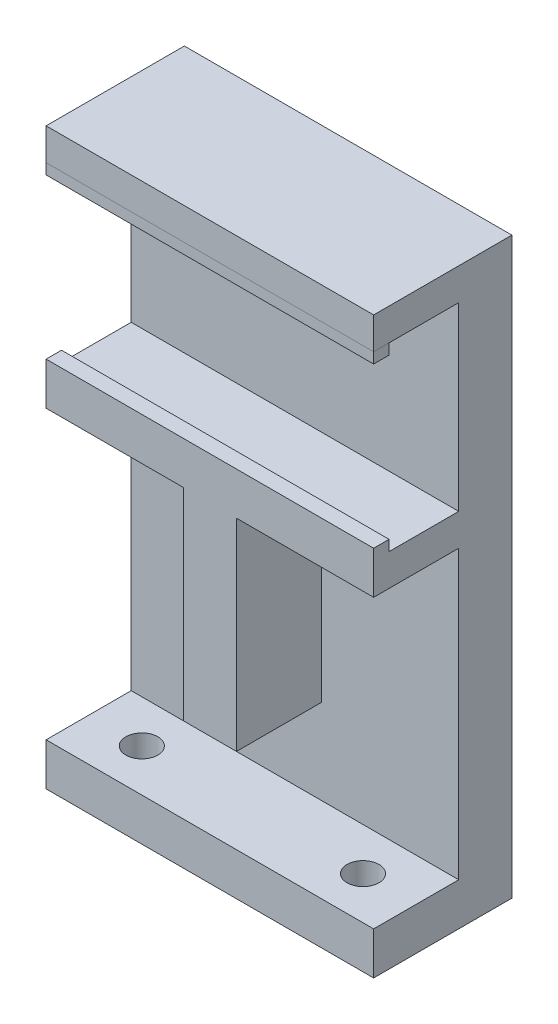
ISO-10303-21;
HEADER;
FILE_DESCRIPTION(('STEP AP214'),'2;1');
FILE_NAME('part.step','',(''),(''),'','','');
FILE_SCHEMA(('AUTOMOTIVE_DESIGN { 1 0 10303 214 1 1 1 1 }'));
ENDSEC;
DATA;
#1=APPLICATION_CONTEXT('core data for automotive mechanical design processes');
#2=APPLICATION_PROTOCOL_DEFINITION('international standard','automotive_design',2000,#1);
#3=PRODUCT_CONTEXT('',#1,'mechanical');
#4=PRODUCT('Part','Part','',(#3));
#5=PRODUCT_RELATED_PRODUCT_CATEGORY('part','',(#4));
#6=PRODUCT_DEFINITION_FORMATION('','',#4);
#7=PRODUCT_DEFINITION_CONTEXT('part definition',#1,'design');
#8=PRODUCT_DEFINITION('design','',#6,#7);
#9=PRODUCT_DEFINITION_SHAPE('','',#8);
#10=(LENGTH_UNIT() NAMED_UNIT(*) SI_UNIT(.MILLI.,.METRE.));
#11=(NAMED_UNIT(*) PLANE_ANGLE_UNIT() SI_UNIT($,.RADIAN.));
#12=(NAMED_UNIT(*) SI_UNIT($,.STERADIAN.) SOLID_ANGLE_UNIT());
#13=UNCERTAINTY_MEASURE_WITH_UNIT(LENGTH_MEASURE(1.E-05),#10,'distance_accuracy_value','');
#14=(GEOMETRIC_REPRESENTATION_CONTEXT(3) GLOBAL_UNCERTAINTY_ASSIGNED_CONTEXT((#13)) GLOBAL_UNIT_ASSIGNED_CONTEXT((#10,
#11,#12)) REPRESENTATION_CONTEXT('',''));
#15=CARTESIAN_POINT('',(0.,0.,0.));
#16=DIRECTION('',(0.,0.,1.));
#17=DIRECTION('',(1.,0.,0.));
#18=AXIS2_PLACEMENT_3D('',#15,#16,#17);
#19=CARTESIAN_POINT('',(-5.00000000014378E-05,39.,13.));
#20=DIRECTION('',(0.,0.,1.));
#21=DIRECTION('',(1.,0.,0.));
#22=AXIS2_PLACEMENT_3D('',#19,#20,#21);
#23=PLANE('',#22);
#24=DIRECTION('',(0.,-1.,0.));
#25=VECTOR('',#24,1.);
#26=CARTESIAN_POINT('',(30.8,39.,13.));
#27=LINE('',#26,#25);
#28=CARTESIAN_POINT('',(30.8,39.,13.));
#29=VERTEX_POINT('',#28);
#30=CARTESIAN_POINT('',(30.8,38.,13.));
#31=VERTEX_POINT('',#30);
#32=EDGE_CURVE('E111',#29,#31,#27,.T.);
#33=ORIENTED_EDGE('',*,*,#32,.F.);
#34=DIRECTION('',(1.,0.,0.));
#35=VECTOR('',#34,1.);
#36=CARTESIAN_POINT('',(-5.00000000014378E-05,39.,13.));
#37=LINE('',#36,#35);
#38=CARTESIAN_POINT('',(-5.00000000014378E-05,39.,13.));
#39=VERTEX_POINT('',#38);
#40=EDGE_CURVE('E12',#39,#29,#37,.T.);
#41=ORIENTED_EDGE('',*,*,#40,.F.);
#42=DIRECTION('',(0.,-1.,0.));
#43=VECTOR('',#42,1.);
#44=CARTESIAN_POINT('',(-5.00000000014378E-05,39.,13.));
#45=LINE('',#44,#43);
#46=CARTESIAN_POINT('',(-5.00000000014378E-05,38.,13.));
#47=VERTEX_POINT('',#46);
#48=EDGE_CURVE('E105',#39,#47,#45,.T.);
#49=ORIENTED_EDGE('',*,*,#48,.T.);
#50=DIRECTION('',(1.,0.,0.));
#51=VECTOR('',#50,1.);
#52=CARTESIAN_POINT('',(-5.00000000014378E-05,38.,13.));
#53=LINE('',#52,#51);
#54=EDGE_CURVE('E50',#47,#31,#53,.T.);
#55=ORIENTED_EDGE('',*,*,#54,.T.);
#56=EDGE_LOOP('',(#33,#41,#49,#55));
#57=FACE_BOUND('',#56,.T.);
#58=ADVANCED_FACE('F47',(#57),#23,.T.);
#59=CARTESIAN_POINT('',(-5.00000000014378E-05,39.,13.));
#60=DIRECTION('',(0.,1.,0.));
#61=DIRECTION('',(0.,0.,1.));
#62=AXIS2_PLACEMENT_3D('',#59,#60,#61);
#63=PLANE('',#62);
#64=DIRECTION('',(0.,0.,1.));
#65=VECTOR('',#64,1.);
#66=CARTESIAN_POINT('',(30.8,39.,13.));
#67=LINE('',#66,#65);
#68=CARTESIAN_POINT('',(30.8,39.,11.55));
#69=VERTEX_POINT('',#68);
#70=EDGE_CURVE('E107',#69,#29,#67,.T.);
#71=ORIENTED_EDGE('',*,*,#70,.F.);
#72=DIRECTION('',(1.,0.,0.));
#73=VECTOR('',#72,1.);
#74=CARTESIAN_POINT('',(-5.00000000014378E-05,39.,11.55));
#75=LINE('',#74,#73);
#76=CARTESIAN_POINT('',(-5.00000000014378E-05,39.,11.55));
#77=VERTEX_POINT('',#76);
#78=EDGE_CURVE('E56',#77,#69,#75,.T.);
#79=ORIENTED_EDGE('',*,*,#78,.F.);
#80=DIRECTION('',(0.,0.,1.));
#81=VECTOR('',#80,1.);
#82=CARTESIAN_POINT('',(-5.00000000014378E-05,39.,13.));
#83=LINE('',#82,#81);
#84=EDGE_CURVE('E102',#77,#39,#83,.T.);
#85=ORIENTED_EDGE('',*,*,#84,.T.);
#86=ORIENTED_EDGE('',*,*,#40,.T.);
#87=EDGE_LOOP('',(#71,#79,#85,#86));
#88=FACE_BOUND('',#87,.T.);
#89=ADVANCED_FACE('F121',(#88),#63,.T.);
#90=CARTESIAN_POINT('',(-5.00000000014378E-05,39.,11.55));
#91=DIRECTION('',(0.,0.,-1.));
#92=DIRECTION('',(-1.,0.,0.));
#93=AXIS2_PLACEMENT_3D('',#90,#91,#92);
#94=PLANE('',#93);
#95=DIRECTION('',(0.,1.,0.));
#96=VECTOR('',#95,1.);
#97=CARTESIAN_POINT('',(30.8,39.,11.55));
#98=LINE('',#97,#96);
#99=CARTESIAN_POINT('',(30.8,38.,11.55));
#100=VERTEX_POINT('',#99);
#101=EDGE_CURVE('E97',#100,#69,#98,.T.);
#102=ORIENTED_EDGE('',*,*,#101,.F.);
#103=DIRECTION('',(1.,0.,0.));
#104=VECTOR('',#103,1.);
#105=CARTESIAN_POINT('',(-5.00000000014378E-05,38.,11.55));
#106=LINE('',#105,#104);
#107=CARTESIAN_POINT('',(-5.00000000014378E-05,38.,11.55));
#108=VERTEX_POINT('',#107);
#109=EDGE_CURVE('E92',#108,#100,#106,.T.);
#110=ORIENTED_EDGE('',*,*,#109,.F.);
#111=DIRECTION('',(0.,1.,0.));
#112=VECTOR('',#111,1.);
#113=CARTESIAN_POINT('',(-5.00000000014378E-05,39.,11.55));
#114=LINE('',#113,#112);
#115=EDGE_CURVE('E95',#108,#77,#114,.T.);
#116=ORIENTED_EDGE('',*,*,#115,.T.);
#117=ORIENTED_EDGE('',*,*,#78,.T.);
#118=EDGE_LOOP('',(#102,#110,#116,#117));
#119=FACE_BOUND('',#118,.T.);
#120=ADVANCED_FACE('F94',(#119),#94,.T.);
#121=CARTESIAN_POINT('',(-5.00000000014378E-05,38.,13.));
#122=DIRECTION('',(0.,-1.,0.));
#123=DIRECTION('',(0.,0.,-1.));
#124=AXIS2_PLACEMENT_3D('',#121,#122,#123);
#125=PLANE('',#124);
#126=DIRECTION('',(0.,0.,-1.));
#127=VECTOR('',#126,1.);
#128=CARTESIAN_POINT('',(30.8,38.,13.));
#129=LINE('',#128,#127);
#130=EDGE_CURVE('E114',#31,#100,#129,.T.);
#131=ORIENTED_EDGE('',*,*,#130,.F.);
#132=ORIENTED_EDGE('',*,*,#54,.F.);
#133=DIRECTION('',(0.,0.,-1.));
#134=VECTOR('',#133,1.);
#135=CARTESIAN_POINT('',(-5.00000000014378E-05,38.,13.));
#136=LINE('',#135,#134);
#137=EDGE_CURVE('E101',#47,#108,#136,.T.);
#138=ORIENTED_EDGE('',*,*,#137,.T.);
#139=ORIENTED_EDGE('',*,*,#109,.T.);
#140=EDGE_LOOP('',(#131,#132,#138,#139));
#141=FACE_BOUND('',#140,.T.);
#142=ADVANCED_FACE('F104',(#141),#125,.T.);
#143=CARTESIAN_POINT('',(-5.00000000014378E-05,38.,13.));
#144=DIRECTION('',(1.,0.,0.));
#145=DIRECTION('',(0.,0.,-1.));
#146=AXIS2_PLACEMENT_3D('',#143,#144,#145);
#147=PLANE('',#146);
#148=ORIENTED_EDGE('',*,*,#48,.F.);
#149=ORIENTED_EDGE('',*,*,#84,.F.);
#150=ORIENTED_EDGE('',*,*,#115,.F.);
#151=ORIENTED_EDGE('',*,*,#137,.F.);
#152=EDGE_LOOP('',(#148,#149,#150,#151));
#153=FACE_BOUND('',#152,.T.);
#154=ADVANCED_FACE('F100',(#153),#147,.F.);
#155=CARTESIAN_POINT('',(30.8,38.,13.));
#156=DIRECTION('',(1.,0.,0.));
#157=DIRECTION('',(0.,0.,-1.));
#158=AXIS2_PLACEMENT_3D('',#155,#156,#157);
#159=PLANE('',#158);
#160=ORIENTED_EDGE('',*,*,#32,.T.);
#161=ORIENTED_EDGE('',*,*,#130,.T.);
#162=ORIENTED_EDGE('',*,*,#101,.T.);
#163=ORIENTED_EDGE('',*,*,#70,.T.);
#164=EDGE_LOOP('',(#160,#161,#162,#163));
#165=FACE_BOUND('',#164,.T.);
#166=ADVANCED_FACE('F120',(#165),#159,.T.);
#167=CLOSED_SHELL('',(#58,#89,#120,#142,#154,#166));
#168=MANIFOLD_SOLID_BREP('B2',#167);
#169=CARTESIAN_POINT('',(0.,39.,5.));
#170=DIRECTION('',(0.,0.,-1.));
#171=DIRECTION('',(-1.,0.,0.));
#172=AXIS2_PLACEMENT_3D('',#169,#170,#171);
#173=PLANE('',#172);
#174=DIRECTION('',(1.,0.,0.));
#175=VECTOR('',#174,1.);
#176=CARTESIAN_POINT('',(0.,39.,5.));
#177=LINE('',#176,#175);
#178=CARTESIAN_POINT('',(0.,39.,5.));
#179=VERTEX_POINT('',#178);
#180=CARTESIAN_POINT('',(30.8,39.,5.));
#181=VERTEX_POINT('',#180);
#182=EDGE_CURVE('E336',#179,#181,#177,.T.);
#183=ORIENTED_EDGE('',*,*,#182,.F.);
#184=DIRECTION('',(0.,-1.,0.));
#185=VECTOR('',#184,1.);
#186=CARTESIAN_POINT('',(0.,0.,5.));
#187=LINE('',#186,#185);
#188=CARTESIAN_POINT('',(0.,22.,5.));
#189=VERTEX_POINT('',#188);
#190=EDGE_CURVE('E175',#179,#189,#187,.T.);
#191=ORIENTED_EDGE('',*,*,#190,.T.);
#192=DIRECTION('',(-1.,0.,0.));
#193=VECTOR('',#192,1.);
#194=CARTESIAN_POINT('',(0.,22.,5.));
#195=LINE('',#194,#193);
#196=CARTESIAN_POINT('',(30.8,22.,5.));
#197=VERTEX_POINT('',#196);
#198=EDGE_CURVE('E431',#197,#189,#195,.T.);
#199=ORIENTED_EDGE('',*,*,#198,.F.);
#200=DIRECTION('',(0.,1.,0.));
#201=VECTOR('',#200,1.);
#202=CARTESIAN_POINT('',(30.8,0.,5.));
#203=LINE('',#202,#201);
#204=EDGE_CURVE('E499',#197,#181,#203,.T.);
#205=ORIENTED_EDGE('',*,*,#204,.T.);
#206=EDGE_LOOP('',(#183,#191,#199,#205));
#207=FACE_BOUND('',#206,.T.);
#208=ADVANCED_FACE('F171',(#207),#173,.F.);
#209=DIRECTION('',(0.,1.,0.));
#210=VECTOR('',#209,1.);
#211=CARTESIAN_POINT('',(17.9,0.,5.));
#212=LINE('',#211,#210);
#213=CARTESIAN_POINT('',(17.9,0.,5.));
#214=VERTEX_POINT('',#213);
#215=CARTESIAN_POINT('',(17.9,19.,5.));
#216=VERTEX_POINT('',#215);
#217=EDGE_CURVE('E419',#214,#216,#212,.T.);
#218=ORIENTED_EDGE('',*,*,#217,.F.);
#219=DIRECTION('',(1.,0.,0.));
#220=VECTOR('',#219,1.);
#221=CARTESIAN_POINT('',(-17.6918060129541,0.,5.));
#222=LINE('',#221,#220);
#223=CARTESIAN_POINT('',(12.9,0.,5.));
#224=VERTEX_POINT('',#223);
#225=EDGE_CURVE('E45',#224,#214,#222,.T.);
#226=ORIENTED_EDGE('',*,*,#225,.F.);
#227=DIRECTION('',(0.,-1.,0.));
#228=VECTOR('',#227,1.);
#229=CARTESIAN_POINT('',(12.9,0.,5.));
#230=LINE('',#229,#228);
#231=CARTESIAN_POINT('',(12.9,19.,5.));
#232=VERTEX_POINT('',#231);
#233=EDGE_CURVE('E398',#232,#224,#230,.T.);
#234=ORIENTED_EDGE('',*,*,#233,.F.);
#235=DIRECTION('',(1.,0.,0.));
#236=VECTOR('',#235,1.);
#237=CARTESIAN_POINT('',(0.,19.,5.));
#238=LINE('',#237,#236);
#239=CARTESIAN_POINT('',(0.,19.,5.));
#240=VERTEX_POINT('',#239);
#241=EDGE_CURVE('E443',#240,#232,#238,.T.);
#242=ORIENTED_EDGE('',*,*,#241,.F.);
#243=CARTESIAN_POINT('',(0.,-8.,5.));
#244=VERTEX_POINT('',#243);
#245=EDGE_CURVE('E504',#240,#244,#187,.T.);
#246=ORIENTED_EDGE('',*,*,#245,.T.);
#247=DIRECTION('',(1.,0.,0.));
#248=VECTOR('',#247,1.);
#249=CARTESIAN_POINT('',(-17.6918060129541,-8.,5.));
#250=LINE('',#249,#248);
#251=CARTESIAN_POINT('',(30.8,-8.,5.));
#252=VERTEX_POINT('',#251);
#253=EDGE_CURVE('E406',#244,#252,#250,.T.);
#254=ORIENTED_EDGE('',*,*,#253,.T.);
#255=CARTESIAN_POINT('',(30.8,19.,5.));
#256=VERTEX_POINT('',#255);
#257=EDGE_CURVE('E181',#252,#256,#203,.T.);
#258=ORIENTED_EDGE('',*,*,#257,.T.);
#259=EDGE_CURVE('E447',#216,#256,#238,.T.);
#260=ORIENTED_EDGE('',*,*,#259,.F.);
#261=EDGE_LOOP('',(#218,#226,#234,#242,#246,#254,#258,#260));
#262=FACE_BOUND('',#261,.T.);
#263=ADVANCED_FACE('F496',(#262),#173,.F.);
#264=CARTESIAN_POINT('',(0.,19.,13.));
#265=DIRECTION('',(0.,1.,0.));
#266=DIRECTION('',(0.,0.,1.));
#267=AXIS2_PLACEMENT_3D('',#264,#265,#266);
#268=PLANE('',#267);
#269=DIRECTION('',(0.,0.,-1.));
#270=VECTOR('',#269,1.);
#271=CARTESIAN_POINT('',(12.9,19.,13.));
#272=LINE('',#271,#270);
#273=CARTESIAN_POINT('',(12.9,19.,13.));
#274=VERTEX_POINT('',#273);
#275=EDGE_CURVE('E423',#274,#232,#272,.T.);
#276=ORIENTED_EDGE('',*,*,#275,.F.);
#277=DIRECTION('',(1.,0.,0.));
#278=VECTOR('',#277,1.);
#279=CARTESIAN_POINT('',(0.,19.,13.));
#280=LINE('',#279,#278);
#281=CARTESIAN_POINT('',(0.,19.,13.));
#282=VERTEX_POINT('',#281);
#283=EDGE_CURVE('E432',#282,#274,#280,.T.);
#284=ORIENTED_EDGE('',*,*,#283,.F.);
#285=DIRECTION('',(0.,0.,-1.));
#286=VECTOR('',#285,1.);
#287=CARTESIAN_POINT('',(0.,19.,13.));
#288=LINE('',#287,#286);
#289=EDGE_CURVE('E480',#282,#240,#288,.T.);
#290=ORIENTED_EDGE('',*,*,#289,.T.);
#291=ORIENTED_EDGE('',*,*,#241,.T.);
#292=EDGE_LOOP('',(#276,#284,#290,#291));
#293=FACE_BOUND('',#292,.T.);
#294=ADVANCED_FACE('F540',(#293),#268,.F.);
#295=DIRECTION('',(0.,0.,-1.));
#296=VECTOR('',#295,1.);
#297=CARTESIAN_POINT('',(17.9,19.,13.));
#298=LINE('',#297,#296);
#299=CARTESIAN_POINT('',(17.9,19.,13.));
#300=VERTEX_POINT('',#299);
#301=EDGE_CURVE('E189',#300,#216,#298,.T.);
#302=ORIENTED_EDGE('',*,*,#301,.T.);
#303=ORIENTED_EDGE('',*,*,#259,.T.);
#304=DIRECTION('',(0.,0.,-1.));
#305=VECTOR('',#304,1.);
#306=CARTESIAN_POINT('',(30.8,19.,13.));
#307=LINE('',#306,#305);
#308=CARTESIAN_POINT('',(30.8,19.,13.));
#309=VERTEX_POINT('',#308);
#310=EDGE_CURVE('E484',#309,#256,#307,.T.);
#311=ORIENTED_EDGE('',*,*,#310,.F.);
#312=EDGE_CURVE('E430',#300,#309,#280,.T.);
#313=ORIENTED_EDGE('',*,*,#312,.F.);
#314=EDGE_LOOP('',(#302,#303,#311,#313));
#315=FACE_BOUND('',#314,.T.);
#316=ADVANCED_FACE('F492',(#315),#268,.F.);
#317=CARTESIAN_POINT('',(0.,0.,5.));
#318=DIRECTION('',(1.,0.,0.));
#319=DIRECTION('',(0.,0.,-1.));
#320=AXIS2_PLACEMENT_3D('',#317,#318,#319);
#321=PLANE('',#320);
#322=DIRECTION('',(0.,-1.,0.));
#323=VECTOR('',#322,1.);
#324=CARTESIAN_POINT('',(0.,0.,0.));
#325=LINE('',#324,#323);
#326=CARTESIAN_POINT('',(0.,42.,0.));
#327=VERTEX_POINT('',#326);
#328=CARTESIAN_POINT('',(0.,-12.,0.));
#329=VERTEX_POINT('',#328);
#330=EDGE_CURVE('E483',#327,#329,#325,.T.);
#331=ORIENTED_EDGE('',*,*,#330,.T.);
#332=DIRECTION('',(0.,0.,1.));
#333=VECTOR('',#332,1.);
#334=CARTESIAN_POINT('',(0.,-12.,13.));
#335=LINE('',#334,#333);
#336=CARTESIAN_POINT('',(0.,-12.,13.));
#337=VERTEX_POINT('',#336);
#338=EDGE_CURVE('E396',#329,#337,#335,.T.);
#339=ORIENTED_EDGE('',*,*,#338,.T.);
#340=DIRECTION('',(0.,1.,0.));
#341=VECTOR('',#340,1.);
#342=CARTESIAN_POINT('',(0.,-8.,13.));
#343=LINE('',#342,#341);
#344=CARTESIAN_POINT('',(0.,-8.,13.));
#345=VERTEX_POINT('',#344);
#346=EDGE_CURVE('E393',#337,#345,#343,.T.);
#347=ORIENTED_EDGE('',*,*,#346,.T.);
#348=DIRECTION('',(0.,0.,-1.));
#349=VECTOR('',#348,1.);
#350=CARTESIAN_POINT('',(0.,-8.,5.));
#351=LINE('',#350,#349);
#352=EDGE_CURVE('E390',#345,#244,#351,.T.);
#353=ORIENTED_EDGE('',*,*,#352,.T.);
#354=ORIENTED_EDGE('',*,*,#245,.F.);
#355=ORIENTED_EDGE('',*,*,#289,.F.);
#356=DIRECTION('',(0.,-1.,0.));
#357=VECTOR('',#356,1.);
#358=CARTESIAN_POINT('',(0.,22.,13.));
#359=LINE('',#358,#357);
#360=CARTESIAN_POINT('',(0.,22.,13.));
#361=VERTEX_POINT('',#360);
#362=EDGE_CURVE('E427',#361,#282,#359,.T.);
#363=ORIENTED_EDGE('',*,*,#362,.F.);
#364=DIRECTION('',(0.,0.,-1.));
#365=VECTOR('',#364,1.);
#366=CARTESIAN_POINT('',(0.,22.,13.));
#367=LINE('',#366,#365);
#368=CARTESIAN_POINT('',(0.,22.,11.55));
#369=VERTEX_POINT('',#368);
#370=EDGE_CURVE('E471',#361,#369,#367,.T.);
#371=ORIENTED_EDGE('',*,*,#370,.T.);
#372=EDGE_CURVE('E437',#369,#189,#367,.T.);
#373=ORIENTED_EDGE('',*,*,#372,.T.);
#374=ORIENTED_EDGE('',*,*,#190,.F.);
#375=DIRECTION('',(0.,0.,-1.));
#376=VECTOR('',#375,1.);
#377=CARTESIAN_POINT('',(0.,39.,13.));
#378=LINE('',#377,#376);
#379=CARTESIAN_POINT('',(0.,39.,13.));
#380=VERTEX_POINT('',#379);
#381=EDGE_CURVE('E344',#380,#179,#378,.T.);
#382=ORIENTED_EDGE('',*,*,#381,.F.);
#383=DIRECTION('',(0.,-1.,0.));
#384=VECTOR('',#383,1.);
#385=CARTESIAN_POINT('',(0.,39.,13.));
#386=LINE('',#385,#384);
#387=CARTESIAN_POINT('',(0.,42.,13.));
#388=VERTEX_POINT('',#387);
#389=EDGE_CURVE('E330',#388,#380,#386,.T.);
#390=ORIENTED_EDGE('',*,*,#389,.F.);
#391=DIRECTION('',(0.,0.,1.));
#392=VECTOR('',#391,1.);
#393=CARTESIAN_POINT('',(0.,42.,0.));
#394=LINE('',#393,#392);
#395=EDGE_CURVE('E321',#327,#388,#394,.T.);
#396=ORIENTED_EDGE('',*,*,#395,.F.);
#397=EDGE_LOOP('',(#331,#339,#347,#353,#354,#355,#363,#371,#373,#374,#382,#390,#396));
#398=FACE_BOUND('',#397,.T.);
#399=ADVANCED_FACE('F173',(#398),#321,.F.);
#400=CARTESIAN_POINT('',(0.,0.,5.));
#401=DIRECTION('',(0.,1.,0.));
#402=DIRECTION('',(0.,0.,1.));
#403=AXIS2_PLACEMENT_3D('',#400,#401,#402);
#404=PLANE('',#403);
#405=DIRECTION('',(0.,0.,-1.));
#406=VECTOR('',#405,1.);
#407=CARTESIAN_POINT('',(12.9,0.,13.));
#408=LINE('',#407,#406);
#409=CARTESIAN_POINT('',(12.9,0.,13.));
#410=VERTEX_POINT('',#409);
#411=EDGE_CURVE('E450',#410,#224,#408,.T.);
#412=ORIENTED_EDGE('',*,*,#411,.T.);
#413=ORIENTED_EDGE('',*,*,#225,.T.);
#414=DIRECTION('',(0.,0.,-1.));
#415=VECTOR('',#414,1.);
#416=CARTESIAN_POINT('',(17.9,0.,13.));
#417=LINE('',#416,#415);
#418=CARTESIAN_POINT('',(17.9,0.,13.));
#419=VERTEX_POINT('',#418);
#420=EDGE_CURVE('E426',#419,#214,#417,.T.);
#421=ORIENTED_EDGE('',*,*,#420,.F.);
#422=DIRECTION('',(1.,0.,0.));
#423=VECTOR('',#422,1.);
#424=CARTESIAN_POINT('',(12.9,0.,13.));
#425=LINE('',#424,#423);
#426=EDGE_CURVE('E418',#410,#419,#425,.T.);
#427=ORIENTED_EDGE('',*,*,#426,.F.);
#428=EDGE_LOOP('',(#412,#413,#421,#427));
#429=FACE_BOUND('',#428,.T.);
#430=ADVANCED_FACE('F543',(#429),#404,.F.);
#431=CARTESIAN_POINT('',(30.8,0.,5.));
#432=DIRECTION('',(-1.,0.,0.));
#433=DIRECTION('',(0.,0.,1.));
#434=AXIS2_PLACEMENT_3D('',#431,#432,#433);
#435=PLANE('',#434);
#436=DIRECTION('',(0.,1.,0.));
#437=VECTOR('',#436,1.);
#438=CARTESIAN_POINT('',(30.8,0.,0.));
#439=LINE('',#438,#437);
#440=CARTESIAN_POINT('',(30.8,-12.,0.));
#441=VERTEX_POINT('',#440);
#442=CARTESIAN_POINT('',(30.8,42.,0.));
#443=VERTEX_POINT('',#442);
#444=EDGE_CURVE('E317',#441,#443,#439,.T.);
#445=ORIENTED_EDGE('',*,*,#444,.T.);
#446=DIRECTION('',(0.,0.,1.));
#447=VECTOR('',#446,1.);
#448=CARTESIAN_POINT('',(30.8,42.,0.));
#449=LINE('',#448,#447);
#450=CARTESIAN_POINT('',(30.8,42.,13.));
#451=VERTEX_POINT('',#450);
#452=EDGE_CURVE('E310',#443,#451,#449,.T.);
#453=ORIENTED_EDGE('',*,*,#452,.T.);
#454=DIRECTION('',(0.,1.,0.));
#455=VECTOR('',#454,1.);
#456=CARTESIAN_POINT('',(30.8,42.,13.));
#457=LINE('',#456,#455);
#458=CARTESIAN_POINT('',(30.8,39.,13.));
#459=VERTEX_POINT('',#458);
#460=EDGE_CURVE('E315',#459,#451,#457,.T.);
#461=ORIENTED_EDGE('',*,*,#460,.F.);
#462=DIRECTION('',(0.,0.,-1.));
#463=VECTOR('',#462,1.);
#464=CARTESIAN_POINT('',(30.8,39.,13.));
#465=LINE('',#464,#463);
#466=EDGE_CURVE('E341',#459,#181,#465,.T.);
#467=ORIENTED_EDGE('',*,*,#466,.T.);
#468=ORIENTED_EDGE('',*,*,#204,.F.);
#469=DIRECTION('',(0.,0.,-1.));
#470=VECTOR('',#469,1.);
#471=CARTESIAN_POINT('',(30.8,22.,13.));
#472=LINE('',#471,#470);
#473=CARTESIAN_POINT('',(30.8,22.,11.55));
#474=VERTEX_POINT('',#473);
#475=EDGE_CURVE('E197',#474,#197,#472,.T.);
#476=ORIENTED_EDGE('',*,*,#475,.F.);
#477=DIRECTION('',(0.,1.,0.));
#478=VECTOR('',#477,1.);
#479=CARTESIAN_POINT('',(30.8,22.,11.55));
#480=LINE('',#479,#478);
#481=CARTESIAN_POINT('',(30.8,23.,11.55));
#482=VERTEX_POINT('',#481);
#483=EDGE_CURVE('E348',#474,#482,#480,.T.);
#484=ORIENTED_EDGE('',*,*,#483,.T.);
#485=DIRECTION('',(0.,0.,1.));
#486=VECTOR('',#485,1.);
#487=CARTESIAN_POINT('',(30.8,23.,13.));
#488=LINE('',#487,#486);
#489=CARTESIAN_POINT('',(30.8,23.,13.));
#490=VERTEX_POINT('',#489);
#491=EDGE_CURVE('E353',#482,#490,#488,.T.);
#492=ORIENTED_EDGE('',*,*,#491,.T.);
#493=DIRECTION('',(0.,1.,0.));
#494=VECTOR('',#493,1.);
#495=CARTESIAN_POINT('',(30.8,22.,13.));
#496=LINE('',#495,#494);
#497=EDGE_CURVE('E435',#309,#490,#496,.T.);
#498=ORIENTED_EDGE('',*,*,#497,.F.);
#499=ORIENTED_EDGE('',*,*,#310,.T.);
#500=ORIENTED_EDGE('',*,*,#257,.F.);
#501=DIRECTION('',(0.,0.,1.));
#502=VECTOR('',#501,1.);
#503=CARTESIAN_POINT('',(30.8,-8.,5.));
#504=LINE('',#503,#502);
#505=CARTESIAN_POINT('',(30.8,-8.,13.));
#506=VERTEX_POINT('',#505);
#507=EDGE_CURVE('E387',#252,#506,#504,.T.);
#508=ORIENTED_EDGE('',*,*,#507,.T.);
#509=DIRECTION('',(0.,-1.,0.));
#510=VECTOR('',#509,1.);
#511=CARTESIAN_POINT('',(30.8,-8.,13.));
#512=LINE('',#511,#510);
#513=CARTESIAN_POINT('',(30.8,-12.,13.));
#514=VERTEX_POINT('',#513);
#515=EDGE_CURVE('E401',#506,#514,#512,.T.);
#516=ORIENTED_EDGE('',*,*,#515,.T.);
#517=DIRECTION('',(0.,0.,-1.));
#518=VECTOR('',#517,1.);
#519=CARTESIAN_POINT('',(30.8,-12.,13.));
#520=LINE('',#519,#518);
#521=EDGE_CURVE('E404',#514,#441,#520,.T.);
#522=ORIENTED_EDGE('',*,*,#521,.T.);
#523=EDGE_LOOP('',(#445,#453,#461,#467,#468,#476,#484,#492,#498,#499,#500,#508,#516,#522));
#524=FACE_BOUND('',#523,.T.);
#525=ADVANCED_FACE('F312',(#524),#435,.F.);
#526=CARTESIAN_POINT('',(0.,39.,0.));
#527=DIRECTION('',(0.,0.,-1.));
#528=DIRECTION('',(-1.,0.,0.));
#529=AXIS2_PLACEMENT_3D('',#526,#527,#528);
#530=PLANE('',#529);
#531=ORIENTED_EDGE('',*,*,#330,.F.);
#532=DIRECTION('',(1.,0.,0.));
#533=VECTOR('',#532,1.);
#534=CARTESIAN_POINT('',(30.8,42.,0.));
#535=LINE('',#534,#533);
#536=EDGE_CURVE('E322',#327,#443,#535,.T.);
#537=ORIENTED_EDGE('',*,*,#536,.T.);
#538=ORIENTED_EDGE('',*,*,#444,.F.);
#539=DIRECTION('',(1.,0.,0.));
#540=VECTOR('',#539,1.);
#541=CARTESIAN_POINT('',(-17.6918060129541,-12.,0.));
#542=LINE('',#541,#540);
#543=EDGE_CURVE('E394',#329,#441,#542,.T.);
#544=ORIENTED_EDGE('',*,*,#543,.F.);
#545=EDGE_LOOP('',(#531,#537,#538,#544));
#546=FACE_BOUND('',#545,.T.);
#547=ADVANCED_FACE('F523',(#546),#530,.T.);
#548=CARTESIAN_POINT('',(0.,22.,13.));
#549=DIRECTION('',(0.,-1.,0.));
#550=DIRECTION('',(0.,0.,-1.));
#551=AXIS2_PLACEMENT_3D('',#548,#549,#550);
#552=PLANE('',#551);
#553=ORIENTED_EDGE('',*,*,#372,.F.);
#554=DIRECTION('',(1.,0.,0.));
#555=VECTOR('',#554,1.);
#556=CARTESIAN_POINT('',(-5.00000000014378E-05,22.,11.55));
#557=LINE('',#556,#555);
#558=EDGE_CURVE('E376',#369,#474,#557,.T.);
#559=ORIENTED_EDGE('',*,*,#558,.T.);
#560=ORIENTED_EDGE('',*,*,#475,.T.);
#561=ORIENTED_EDGE('',*,*,#198,.T.);
#562=EDGE_LOOP('',(#553,#559,#560,#561));
#563=FACE_BOUND('',#562,.T.);
#564=ADVANCED_FACE('F520',(#563),#552,.F.);
#565=CARTESIAN_POINT('',(0.,19.,13.));
#566=DIRECTION('',(0.,0.,1.));
#567=DIRECTION('',(1.,0.,0.));
#568=AXIS2_PLACEMENT_3D('',#565,#566,#567);
#569=PLANE('',#568);
#570=ORIENTED_EDGE('',*,*,#362,.T.);
#571=ORIENTED_EDGE('',*,*,#283,.T.);
#572=DIRECTION('',(0.,-1.,0.));
#573=VECTOR('',#572,1.);
#574=CARTESIAN_POINT('',(12.9,0.,13.));
#575=LINE('',#574,#573);
#576=EDGE_CURVE('E415',#274,#410,#575,.T.);
#577=ORIENTED_EDGE('',*,*,#576,.T.);
#578=ORIENTED_EDGE('',*,*,#426,.T.);
#579=DIRECTION('',(0.,1.,0.));
#580=VECTOR('',#579,1.);
#581=CARTESIAN_POINT('',(17.9,0.,13.));
#582=LINE('',#581,#580);
#583=EDGE_CURVE('E421',#419,#300,#582,.T.);
#584=ORIENTED_EDGE('',*,*,#583,.T.);
#585=ORIENTED_EDGE('',*,*,#312,.T.);
#586=ORIENTED_EDGE('',*,*,#497,.T.);
#587=DIRECTION('',(1.,0.,0.));
#588=VECTOR('',#587,1.);
#589=CARTESIAN_POINT('',(-5.00000000014378E-05,23.,13.));
#590=LINE('',#589,#588);
#591=CARTESIAN_POINT('',(-5.00000000014378E-05,23.,13.));
#592=VERTEX_POINT('',#591);
#593=EDGE_CURVE('E367',#592,#490,#590,.T.);
#594=ORIENTED_EDGE('',*,*,#593,.F.);
#595=DIRECTION('',(0.,-1.,0.));
#596=VECTOR('',#595,1.);
#597=CARTESIAN_POINT('',(-5.00000000014378E-05,22.,13.));
#598=LINE('',#597,#596);
#599=CARTESIAN_POINT('',(-5.00000000014378E-05,22.,13.));
#600=VERTEX_POINT('',#599);
#601=EDGE_CURVE('E349',#592,#600,#598,.T.);
#602=ORIENTED_EDGE('',*,*,#601,.T.);
#603=DIRECTION('',(1.,0.,0.));
#604=VECTOR('',#603,1.);
#605=CARTESIAN_POINT('',(-5.00000000014378E-05,22.,13.));
#606=LINE('',#605,#604);
#607=EDGE_CURVE('E362',#600,#361,#606,.T.);
#608=ORIENTED_EDGE('',*,*,#607,.T.);
#609=EDGE_LOOP('',(#570,#571,#577,#578,#584,#585,#586,#594,#602,#608));
#610=FACE_BOUND('',#609,.T.);
#611=ADVANCED_FACE('F522',(#610),#569,.T.);
#612=CARTESIAN_POINT('',(12.9,0.,13.));
#613=DIRECTION('',(1.,0.,0.));
#614=DIRECTION('',(0.,0.,-1.));
#615=AXIS2_PLACEMENT_3D('',#612,#613,#614);
#616=PLANE('',#615);
#617=ORIENTED_EDGE('',*,*,#233,.T.);
#618=ORIENTED_EDGE('',*,*,#411,.F.);
#619=ORIENTED_EDGE('',*,*,#576,.F.);
#620=ORIENTED_EDGE('',*,*,#275,.T.);
#621=EDGE_LOOP('',(#617,#618,#619,#620));
#622=FACE_BOUND('',#621,.T.);
#623=ADVANCED_FACE('F529',(#622),#616,.F.);
#624=CARTESIAN_POINT('',(17.9,0.,13.));
#625=DIRECTION('',(-1.,0.,0.));
#626=DIRECTION('',(0.,0.,1.));
#627=AXIS2_PLACEMENT_3D('',#624,#625,#626);
#628=PLANE('',#627);
#629=ORIENTED_EDGE('',*,*,#217,.T.);
#630=ORIENTED_EDGE('',*,*,#301,.F.);
#631=ORIENTED_EDGE('',*,*,#583,.F.);
#632=ORIENTED_EDGE('',*,*,#420,.T.);
#633=EDGE_LOOP('',(#629,#630,#631,#632));
#634=FACE_BOUND('',#633,.T.);
#635=ADVANCED_FACE('F585',(#634),#628,.F.);
#636=CARTESIAN_POINT('',(-17.6918060129541,-12.,13.));
#637=DIRECTION('',(0.,-1.,0.));
#638=DIRECTION('',(0.,0.,-1.));
#639=AXIS2_PLACEMENT_3D('',#636,#637,#638);
#640=PLANE('',#639);
#641=CARTESIAN_POINT('',(25.8,-12.,9.));
#642=DIRECTION('',(0.,-1.,0.));
#643=DIRECTION('',(0.,0.,-1.));
#644=AXIS2_PLACEMENT_3D('',#641,#642,#643);
#645=CIRCLE('',#644,1.5);
#646=CARTESIAN_POINT('',(25.8,-12.,7.5));
#647=VERTEX_POINT('',#646);
#648=EDGE_CURVE('E370',#647,#647,#645,.F.);
#649=ORIENTED_EDGE('',*,*,#648,.T.);
#650=EDGE_LOOP('',(#649));
#651=FACE_BOUND('',#650,.T.);
#652=CARTESIAN_POINT('',(5.,-12.,9.));
#653=DIRECTION('',(0.,-1.,0.));
#654=DIRECTION('',(0.,0.,-1.));
#655=AXIS2_PLACEMENT_3D('',#652,#653,#654);
#656=CIRCLE('',#655,1.5);
#657=CARTESIAN_POINT('',(5.,-12.,7.5));
#658=VERTEX_POINT('',#657);
#659=EDGE_CURVE('E381',#658,#658,#656,.F.);
#660=ORIENTED_EDGE('',*,*,#659,.T.);
#661=EDGE_LOOP('',(#660));
#662=FACE_BOUND('',#661,.T.);
#663=ORIENTED_EDGE('',*,*,#338,.F.);
#664=ORIENTED_EDGE('',*,*,#543,.T.);
#665=ORIENTED_EDGE('',*,*,#521,.F.);
#666=DIRECTION('',(1.,0.,0.));
#667=VECTOR('',#666,1.);
#668=CARTESIAN_POINT('',(-17.6918060129541,-12.,13.));
#669=LINE('',#668,#667);
#670=EDGE_CURVE('E409',#337,#514,#669,.T.);
#671=ORIENTED_EDGE('',*,*,#670,.F.);
#672=EDGE_LOOP('',(#663,#664,#665,#671));
#673=FACE_BOUND('',#672,.T.);
#674=ADVANCED_FACE('F569',(#651,#662,#673),#640,.T.);
#675=CARTESIAN_POINT('',(-17.6918060129541,-8.,13.));
#676=DIRECTION('',(0.,0.,1.));
#677=DIRECTION('',(0.,-1.,0.));
#678=AXIS2_PLACEMENT_3D('',#675,#676,#677);
#679=PLANE('',#678);
#680=ORIENTED_EDGE('',*,*,#346,.F.);
#681=ORIENTED_EDGE('',*,*,#670,.T.);
#682=ORIENTED_EDGE('',*,*,#515,.F.);
#683=DIRECTION('',(1.,0.,0.));
#684=VECTOR('',#683,1.);
#685=CARTESIAN_POINT('',(-17.6918060129541,-8.,13.));
#686=LINE('',#685,#684);
#687=EDGE_CURVE('E411',#345,#506,#686,.T.);
#688=ORIENTED_EDGE('',*,*,#687,.F.);
#689=EDGE_LOOP('',(#680,#681,#682,#688));
#690=FACE_BOUND('',#689,.T.);
#691=ADVANCED_FACE('F565',(#690),#679,.T.);
#692=CARTESIAN_POINT('',(-17.6918060129541,-8.,5.));
#693=DIRECTION('',(0.,1.,0.));
#694=DIRECTION('',(0.,0.,1.));
#695=AXIS2_PLACEMENT_3D('',#692,#693,#694);
#696=PLANE('',#695);
#697=CARTESIAN_POINT('',(25.8,-8.,9.));
#698=DIRECTION('',(0.,1.,0.));
#699=DIRECTION('',(0.,0.,1.));
#700=AXIS2_PLACEMENT_3D('',#697,#698,#699);
#701=CIRCLE('',#700,1.5);
#702=CARTESIAN_POINT('',(25.8,-8.,10.5));
#703=VERTEX_POINT('',#702);
#704=EDGE_CURVE('E378',#703,#703,#701,.T.);
#705=ORIENTED_EDGE('',*,*,#704,.F.);
#706=EDGE_LOOP('',(#705));
#707=FACE_BOUND('',#706,.T.);
#708=CARTESIAN_POINT('',(5.,-8.,9.));
#709=DIRECTION('',(0.,1.,0.));
#710=DIRECTION('',(0.,0.,1.));
#711=AXIS2_PLACEMENT_3D('',#708,#709,#710);
#712=CIRCLE('',#711,1.5);
#713=CARTESIAN_POINT('',(5.,-8.,10.5));
#714=VERTEX_POINT('',#713);
#715=EDGE_CURVE('E384',#714,#714,#712,.T.);
#716=ORIENTED_EDGE('',*,*,#715,.F.);
#717=EDGE_LOOP('',(#716));
#718=FACE_BOUND('',#717,.T.);
#719=ORIENTED_EDGE('',*,*,#352,.F.);
#720=ORIENTED_EDGE('',*,*,#687,.T.);
#721=ORIENTED_EDGE('',*,*,#507,.F.);
#722=ORIENTED_EDGE('',*,*,#253,.F.);
#723=EDGE_LOOP('',(#719,#720,#721,#722));
#724=FACE_BOUND('',#723,.T.);
#725=ADVANCED_FACE('F561',(#707,#718,#724),#696,.T.);
#726=CARTESIAN_POINT('',(5.,-12.001,9.));
#727=DIRECTION('',(0.,1.,0.));
#728=DIRECTION('',(0.,0.,1.));
#729=AXIS2_PLACEMENT_3D('',#726,#727,#728);
#730=CYLINDRICAL_SURFACE('',#729,1.5);
#731=ORIENTED_EDGE('',*,*,#659,.F.);
#732=EDGE_LOOP('',(#731));
#733=FACE_BOUND('',#732,.T.);
#734=ORIENTED_EDGE('',*,*,#715,.T.);
#735=EDGE_LOOP('',(#734));
#736=FACE_BOUND('',#735,.T.);
#737=ADVANCED_FACE('F598',(#733,#736),#730,.F.);
#738=CARTESIAN_POINT('',(25.8,-12.001,9.));
#739=DIRECTION('',(0.,1.,0.));
#740=DIRECTION('',(0.,0.,1.));
#741=AXIS2_PLACEMENT_3D('',#738,#739,#740);
#742=CYLINDRICAL_SURFACE('',#741,1.5);
#743=ORIENTED_EDGE('',*,*,#648,.F.);
#744=EDGE_LOOP('',(#743));
#745=FACE_BOUND('',#744,.T.);
#746=ORIENTED_EDGE('',*,*,#704,.T.);
#747=EDGE_LOOP('',(#746));
#748=FACE_BOUND('',#747,.T.);
#749=ADVANCED_FACE('F604',(#745,#748),#742,.F.);
#750=CARTESIAN_POINT('',(-5.00000000014378E-05,22.,13.));
#751=DIRECTION('',(0.,-1.,0.));
#752=DIRECTION('',(0.,0.,-1.));
#753=AXIS2_PLACEMENT_3D('',#750,#751,#752);
#754=PLANE('',#753);
#755=ORIENTED_EDGE('',*,*,#370,.F.);
#756=ORIENTED_EDGE('',*,*,#607,.F.);
#757=DIRECTION('',(0.,0.,-1.));
#758=VECTOR('',#757,1.);
#759=CARTESIAN_POINT('',(-5.00000000014378E-05,22.,13.));
#760=LINE('',#759,#758);
#761=CARTESIAN_POINT('',(-5.00000000014378E-05,22.,11.55));
#762=VERTEX_POINT('',#761);
#763=EDGE_CURVE('E352',#600,#762,#760,.T.);
#764=ORIENTED_EDGE('',*,*,#763,.T.);
#765=EDGE_CURVE('E373',#762,#369,#557,.T.);
#766=ORIENTED_EDGE('',*,*,#765,.T.);
#767=EDGE_LOOP('',(#755,#756,#764,#766));
#768=FACE_BOUND('',#767,.T.);
#769=ADVANCED_FACE('F584',(#768),#754,.T.);
#770=CARTESIAN_POINT('',(-5.00000000014378E-05,23.,13.));
#771=DIRECTION('',(0.,1.,0.));
#772=DIRECTION('',(0.,0.,1.));
#773=AXIS2_PLACEMENT_3D('',#770,#771,#772);
#774=PLANE('',#773);
#775=ORIENTED_EDGE('',*,*,#491,.F.);
#776=DIRECTION('',(1.,0.,0.));
#777=VECTOR('',#776,1.);
#778=CARTESIAN_POINT('',(-5.00000000014378E-05,23.,11.55));
#779=LINE('',#778,#777);
#780=CARTESIAN_POINT('',(-5.00000000014378E-05,23.,11.55));
#781=VERTEX_POINT('',#780);
#782=EDGE_CURVE('E371',#781,#482,#779,.T.);
#783=ORIENTED_EDGE('',*,*,#782,.F.);
#784=DIRECTION('',(0.,0.,1.));
#785=VECTOR('',#784,1.);
#786=CARTESIAN_POINT('',(-5.00000000014378E-05,23.,13.));
#787=LINE('',#786,#785);
#788=EDGE_CURVE('E359',#781,#592,#787,.T.);
#789=ORIENTED_EDGE('',*,*,#788,.T.);
#790=ORIENTED_EDGE('',*,*,#593,.T.);
#791=EDGE_LOOP('',(#775,#783,#789,#790));
#792=FACE_BOUND('',#791,.T.);
#793=ADVANCED_FACE('F576',(#792),#774,.T.);
#794=CARTESIAN_POINT('',(-5.00000000014378E-05,22.,11.55));
#795=DIRECTION('',(0.,0.,-1.));
#796=DIRECTION('',(-1.,0.,0.));
#797=AXIS2_PLACEMENT_3D('',#794,#795,#796);
#798=PLANE('',#797);
#799=ORIENTED_EDGE('',*,*,#483,.F.);
#800=ORIENTED_EDGE('',*,*,#558,.F.);
#801=ORIENTED_EDGE('',*,*,#765,.F.);
#802=DIRECTION('',(0.,1.,0.));
#803=VECTOR('',#802,1.);
#804=CARTESIAN_POINT('',(-5.00000000014378E-05,22.,11.55));
#805=LINE('',#804,#803);
#806=EDGE_CURVE('E356',#762,#781,#805,.T.);
#807=ORIENTED_EDGE('',*,*,#806,.T.);
#808=ORIENTED_EDGE('',*,*,#782,.T.);
#809=EDGE_LOOP('',(#799,#800,#801,#807,#808));
#810=FACE_BOUND('',#809,.T.);
#811=ADVANCED_FACE('F611',(#810),#798,.T.);
#812=CARTESIAN_POINT('',(-5.00000000014378E-05,23.,13.));
#813=DIRECTION('',(-1.,0.,0.));
#814=DIRECTION('',(0.,0.,1.));
#815=AXIS2_PLACEMENT_3D('',#812,#813,#814);
#816=PLANE('',#815);
#817=ORIENTED_EDGE('',*,*,#601,.F.);
#818=ORIENTED_EDGE('',*,*,#788,.F.);
#819=ORIENTED_EDGE('',*,*,#806,.F.);
#820=ORIENTED_EDGE('',*,*,#763,.F.);
#821=EDGE_LOOP('',(#817,#818,#819,#820));
#822=FACE_BOUND('',#821,.T.);
#823=ADVANCED_FACE('F581',(#822),#816,.T.);
#824=CARTESIAN_POINT('',(30.8,42.,0.));
#825=DIRECTION('',(0.,-1.,0.));
#826=DIRECTION('',(0.,0.,-1.));
#827=AXIS2_PLACEMENT_3D('',#824,#825,#826);
#828=PLANE('',#827);
#829=ORIENTED_EDGE('',*,*,#395,.T.);
#830=DIRECTION('',(-1.,0.,0.));
#831=VECTOR('',#830,1.);
#832=CARTESIAN_POINT('',(0.,42.,13.));
#833=LINE('',#832,#831);
#834=EDGE_CURVE('E325',#451,#388,#833,.T.);
#835=ORIENTED_EDGE('',*,*,#834,.F.);
#836=ORIENTED_EDGE('',*,*,#452,.F.);
#837=ORIENTED_EDGE('',*,*,#536,.F.);
#838=EDGE_LOOP('',(#829,#835,#836,#837));
#839=FACE_BOUND('',#838,.T.);
#840=ADVANCED_FACE('F326',(#839),#828,.F.);
#841=CARTESIAN_POINT('',(0.,39.,13.));
#842=DIRECTION('',(0.,1.,0.));
#843=DIRECTION('',(0.,0.,1.));
#844=AXIS2_PLACEMENT_3D('',#841,#842,#843);
#845=PLANE('',#844);
#846=ORIENTED_EDGE('',*,*,#182,.T.);
#847=ORIENTED_EDGE('',*,*,#466,.F.);
#848=DIRECTION('',(1.,0.,0.));
#849=VECTOR('',#848,1.);
#850=CARTESIAN_POINT('',(0.,39.,13.));
#851=LINE('',#850,#849);
#852=EDGE_CURVE('E334',#380,#459,#851,.T.);
#853=ORIENTED_EDGE('',*,*,#852,.F.);
#854=ORIENTED_EDGE('',*,*,#381,.T.);
#855=EDGE_LOOP('',(#846,#847,#853,#854));
#856=FACE_BOUND('',#855,.T.);
#857=ADVANCED_FACE('F572',(#856),#845,.F.);
#858=CARTESIAN_POINT('',(30.8,39.,13.));
#859=DIRECTION('',(0.,0.,1.));
#860=DIRECTION('',(1.,0.,0.));
#861=AXIS2_PLACEMENT_3D('',#858,#859,#860);
#862=PLANE('',#861);
#863=ORIENTED_EDGE('',*,*,#460,.T.);
#864=ORIENTED_EDGE('',*,*,#834,.T.);
#865=ORIENTED_EDGE('',*,*,#389,.T.);
#866=ORIENTED_EDGE('',*,*,#852,.T.);
#867=EDGE_LOOP('',(#863,#864,#865,#866));
#868=FACE_BOUND('',#867,.T.);
#869=ADVANCED_FACE('F332',(#868),#862,.T.);
#870=CLOSED_SHELL('',(#208,#263,#294,#316,#399,#430,#525,#547,#564,#611,#623,#635,#674,#691,
#725,#737,#749,#769,#793,#811,#823,#840,#857,#869));
#871=MANIFOLD_SOLID_BREP('B6',#870);
#872=ADVANCED_BREP_SHAPE_REPRESENTATION('',(#18,#168,#871),#14);
#873=SHAPE_DEFINITION_REPRESENTATION(#9,#872);
ENDSEC;
END-ISO-10303-21;
